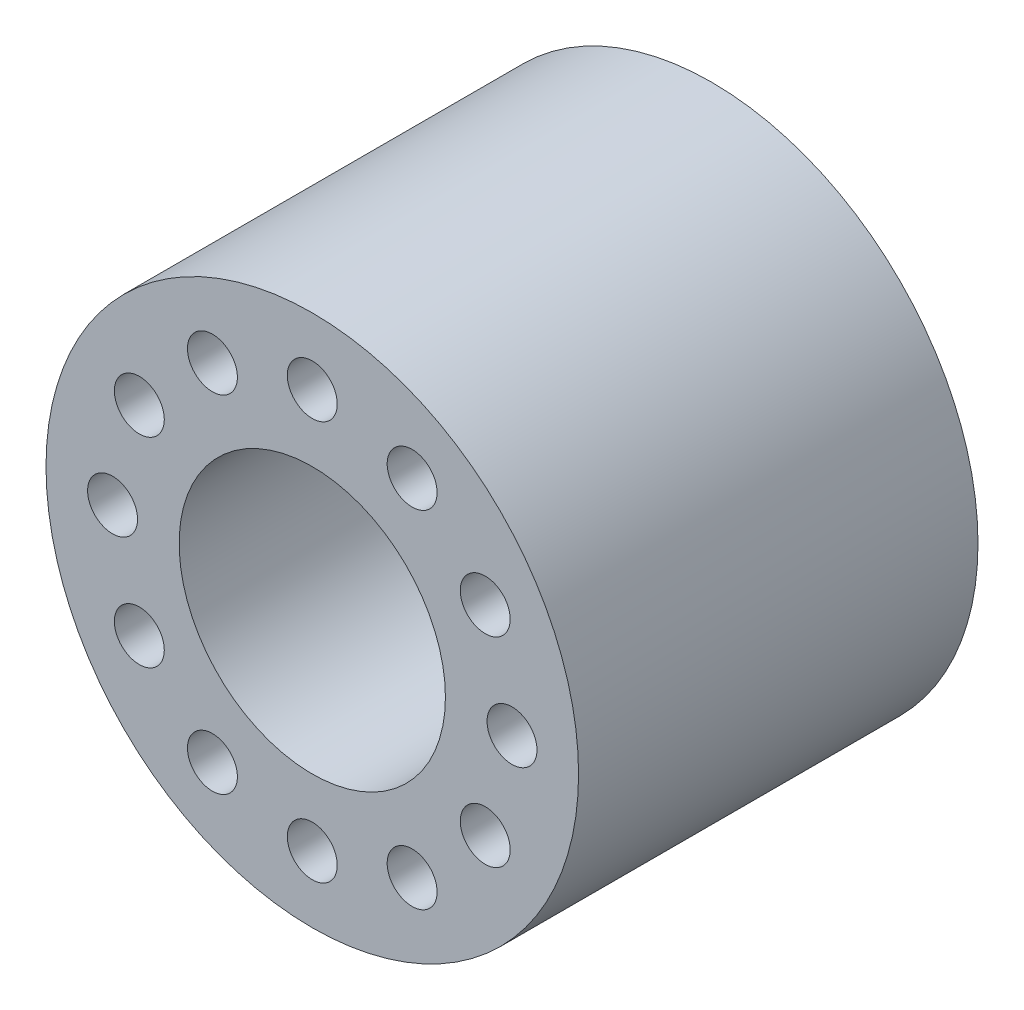
ISO-10303-21;
HEADER;
FILE_DESCRIPTION(('STEP AP214'),'2;1');
FILE_NAME('part.step','',(''),(''),'','','');
FILE_SCHEMA(('AUTOMOTIVE_DESIGN { 1 0 10303 214 1 1 1 1 }'));
ENDSEC;
DATA;
#1=APPLICATION_CONTEXT('core data for automotive mechanical design processes');
#2=APPLICATION_PROTOCOL_DEFINITION('international standard','automotive_design',2000,#1);
#3=PRODUCT_CONTEXT('',#1,'mechanical');
#4=PRODUCT('Part','Part','',(#3));
#5=PRODUCT_RELATED_PRODUCT_CATEGORY('part','',(#4));
#6=PRODUCT_DEFINITION_FORMATION('','',#4);
#7=PRODUCT_DEFINITION_CONTEXT('part definition',#1,'design');
#8=PRODUCT_DEFINITION('design','',#6,#7);
#9=PRODUCT_DEFINITION_SHAPE('','',#8);
#10=(LENGTH_UNIT() NAMED_UNIT(*) SI_UNIT(.MILLI.,.METRE.));
#11=(NAMED_UNIT(*) PLANE_ANGLE_UNIT() SI_UNIT($,.RADIAN.));
#12=(NAMED_UNIT(*) SI_UNIT($,.STERADIAN.) SOLID_ANGLE_UNIT());
#13=UNCERTAINTY_MEASURE_WITH_UNIT(LENGTH_MEASURE(1.E-05),#10,'distance_accuracy_value','');
#14=(GEOMETRIC_REPRESENTATION_CONTEXT(3) GLOBAL_UNCERTAINTY_ASSIGNED_CONTEXT((#13)) GLOBAL_UNIT_ASSIGNED_CONTEXT((#10,
#11,#12)) REPRESENTATION_CONTEXT('',''));
#15=CARTESIAN_POINT('',(0.,0.,0.));
#16=DIRECTION('',(0.,0.,1.));
#17=DIRECTION('',(1.,0.,0.));
#18=AXIS2_PLACEMENT_3D('',#15,#16,#17);
#19=CARTESIAN_POINT('',(0.,0.,12.));
#20=DIRECTION('',(0.,0.,1.));
#21=DIRECTION('',(1.,0.,0.));
#22=AXIS2_PLACEMENT_3D('',#19,#20,#21);
#23=PLANE('',#22);
#24=CARTESIAN_POINT('',(5.19615242270694,3.00000000000009,12.));
#25=DIRECTION('',(0.,0.,1.));
#26=DIRECTION('',(1.,0.,0.));
#27=AXIS2_PLACEMENT_3D('',#24,#25,#26);
#28=CIRCLE('',#27,0.749999999999707);
#29=CARTESIAN_POINT('',(5.94615242270664,3.00000000000009,12.));
#30=VERTEX_POINT('',#29);
#31=EDGE_CURVE('E108',#30,#30,#28,.T.);
#32=ORIENTED_EDGE('',*,*,#31,.F.);
#33=EDGE_LOOP('',(#32));
#34=FACE_BOUND('',#33,.T.);
#35=CARTESIAN_POINT('',(6.16519792277722E-13,6.00000000000062,12.));
#36=DIRECTION('',(0.,0.,1.));
#37=DIRECTION('',(1.,0.,0.));
#38=AXIS2_PLACEMENT_3D('',#35,#36,#37);
#39=CIRCLE('',#38,0.749999999999573);
#40=CARTESIAN_POINT('',(0.750000000000189,6.00000000000062,12.));
#41=VERTEX_POINT('',#40);
#42=EDGE_CURVE('E96',#41,#41,#39,.T.);
#43=ORIENTED_EDGE('',*,*,#42,.F.);
#44=EDGE_LOOP('',(#43));
#45=FACE_BOUND('',#44,.T.);
#46=CARTESIAN_POINT('',(-5.19615242270632,3.00000000000115,12.));
#47=DIRECTION('',(0.,0.,1.));
#48=DIRECTION('',(1.,0.,0.));
#49=AXIS2_PLACEMENT_3D('',#46,#47,#48);
#50=CIRCLE('',#49,0.75000000000003);
#51=CARTESIAN_POINT('',(-4.44615242270629,3.00000000000115,12.));
#52=VERTEX_POINT('',#51);
#53=EDGE_CURVE('E84',#52,#52,#50,.T.);
#54=ORIENTED_EDGE('',*,*,#53,.F.);
#55=EDGE_LOOP('',(#54));
#56=FACE_BOUND('',#55,.T.);
#57=CARTESIAN_POINT('',(-5.19615242270694,-2.99999999999885,12.));
#58=DIRECTION('',(0.,0.,1.));
#59=DIRECTION('',(1.,0.,0.));
#60=AXIS2_PLACEMENT_3D('',#57,#58,#59);
#61=CIRCLE('',#60,0.750000000000624);
#62=CARTESIAN_POINT('',(-4.44615242270632,-2.99999999999885,12.));
#63=VERTEX_POINT('',#62);
#64=EDGE_CURVE('E72',#63,#63,#61,.T.);
#65=ORIENTED_EDGE('',*,*,#64,.F.);
#66=EDGE_LOOP('',(#65));
#67=FACE_BOUND('',#66,.T.);
#68=CARTESIAN_POINT('',(-6.17254580357209E-13,-5.99999999999938,12.));
#69=DIRECTION('',(0.,0.,1.));
#70=DIRECTION('',(1.,0.,0.));
#71=AXIS2_PLACEMENT_3D('',#68,#69,#70);
#72=CIRCLE('',#71,0.750000000000767);
#73=CARTESIAN_POINT('',(0.75000000000015,-5.99999999999938,12.));
#74=VERTEX_POINT('',#73);
#75=EDGE_CURVE('E60',#74,#74,#72,.T.);
#76=ORIENTED_EDGE('',*,*,#75,.F.);
#77=EDGE_LOOP('',(#76));
#78=FACE_BOUND('',#77,.T.);
#79=CARTESIAN_POINT('',(5.19615242270632,-2.99999999999992,12.));
#80=DIRECTION('',(0.,0.,1.));
#81=DIRECTION('',(1.,0.,0.));
#82=AXIS2_PLACEMENT_3D('',#79,#80,#81);
#83=CIRCLE('',#82,0.750000000000318);
#84=CARTESIAN_POINT('',(5.94615242270664,-2.99999999999992,12.));
#85=VERTEX_POINT('',#84);
#86=EDGE_CURVE('E48',#85,#85,#83,.T.);
#87=ORIENTED_EDGE('',*,*,#86,.F.);
#88=EDGE_LOOP('',(#87));
#89=FACE_BOUND('',#88,.T.);
#90=CARTESIAN_POINT('',(0.,0.,12.));
#91=DIRECTION('',(0.,0.,1.));
#92=DIRECTION('',(1.,0.,0.));
#93=AXIS2_PLACEMENT_3D('',#90,#91,#92);
#94=CIRCLE('',#93,8.);
#95=CARTESIAN_POINT('',(8.,0.,12.));
#96=VERTEX_POINT('',#95);
#97=EDGE_CURVE('E10',#96,#96,#94,.T.);
#98=ORIENTED_EDGE('',*,*,#97,.T.);
#99=EDGE_LOOP('',(#98));
#100=FACE_BOUND('',#99,.T.);
#101=CARTESIAN_POINT('',(6.,0.,12.));
#102=DIRECTION('',(0.,0.,1.));
#103=DIRECTION('',(1.,0.,0.));
#104=AXIS2_PLACEMENT_3D('',#101,#102,#103);
#105=CIRCLE('',#104,0.750000000000002);
#106=CARTESIAN_POINT('',(6.75,0.,12.));
#107=VERTEX_POINT('',#106);
#108=EDGE_CURVE('E43',#107,#107,#105,.T.);
#109=ORIENTED_EDGE('',*,*,#108,.F.);
#110=EDGE_LOOP('',(#109));
#111=FACE_BOUND('',#110,.T.);
#112=CARTESIAN_POINT('',(2.99999999999947,-5.19615242270632,12.));
#113=DIRECTION('',(0.,0.,1.));
#114=DIRECTION('',(1.,0.,0.));
#115=AXIS2_PLACEMENT_3D('',#112,#113,#114);
#116=CIRCLE('',#115,0.750000000000599);
#117=CARTESIAN_POINT('',(3.75000000000006,-5.19615242270632,12.));
#118=VERTEX_POINT('',#117);
#119=EDGE_CURVE('E54',#118,#118,#116,.T.);
#120=ORIENTED_EDGE('',*,*,#119,.F.);
#121=EDGE_LOOP('',(#120));
#122=FACE_BOUND('',#121,.T.);
#123=CARTESIAN_POINT('',(-3.00000000000053,-5.19615242270571,12.));
#124=DIRECTION('',(0.,0.,1.));
#125=DIRECTION('',(1.,0.,0.));
#126=AXIS2_PLACEMENT_3D('',#123,#124,#125);
#127=CIRCLE('',#126,0.750000000000777);
#128=CARTESIAN_POINT('',(-2.24999999999976,-5.19615242270571,12.));
#129=VERTEX_POINT('',#128);
#130=EDGE_CURVE('E66',#129,#129,#127,.T.);
#131=ORIENTED_EDGE('',*,*,#130,.F.);
#132=EDGE_LOOP('',(#131));
#133=FACE_BOUND('',#132,.T.);
#134=CARTESIAN_POINT('',(-6.,1.23450916071442E-12,12.));
#135=DIRECTION('',(0.,0.,1.));
#136=DIRECTION('',(1.,0.,0.));
#137=AXIS2_PLACEMENT_3D('',#134,#135,#136);
#138=CIRCLE('',#137,0.750000000000351);
#139=CARTESIAN_POINT('',(-5.24999999999965,1.23450916071442E-12,12.));
#140=VERTEX_POINT('',#139);
#141=EDGE_CURVE('E78',#140,#140,#138,.T.);
#142=ORIENTED_EDGE('',*,*,#141,.F.);
#143=EDGE_LOOP('',(#142));
#144=FACE_BOUND('',#143,.T.);
#145=CARTESIAN_POINT('',(-2.99999999999947,5.19615242270756,12.));
#146=DIRECTION('',(0.,0.,1.));
#147=DIRECTION('',(1.,0.,0.));
#148=AXIS2_PLACEMENT_3D('',#145,#146,#147);
#149=CIRCLE('',#148,0.749999999999745);
#150=CARTESIAN_POINT('',(-2.24999999999972,5.19615242270756,12.));
#151=VERTEX_POINT('',#150);
#152=EDGE_CURVE('E90',#151,#151,#149,.T.);
#153=ORIENTED_EDGE('',*,*,#152,.F.);
#154=EDGE_LOOP('',(#153));
#155=FACE_BOUND('',#154,.T.);
#156=CARTESIAN_POINT('',(3.00000000000053,5.19615242270694,12.));
#157=DIRECTION('',(0.,0.,1.));
#158=DIRECTION('',(1.,0.,0.));
#159=AXIS2_PLACEMENT_3D('',#156,#157,#158);
#160=CIRCLE('',#159,0.749999999999559);
#161=CARTESIAN_POINT('',(3.75000000000009,5.19615242270694,12.));
#162=VERTEX_POINT('',#161);
#163=EDGE_CURVE('E102',#162,#162,#160,.T.);
#164=ORIENTED_EDGE('',*,*,#163,.F.);
#165=EDGE_LOOP('',(#164));
#166=FACE_BOUND('',#165,.T.);
#167=CARTESIAN_POINT('',(0.,0.,12.));
#168=DIRECTION('',(0.,0.,1.));
#169=DIRECTION('',(1.,0.,0.));
#170=AXIS2_PLACEMENT_3D('',#167,#168,#169);
#171=CIRCLE('',#170,4.);
#172=CARTESIAN_POINT('',(4.,0.,12.));
#173=VERTEX_POINT('',#172);
#174=EDGE_CURVE('E114',#173,#173,#171,.T.);
#175=ORIENTED_EDGE('',*,*,#174,.F.);
#176=EDGE_LOOP('',(#175));
#177=FACE_BOUND('',#176,.T.);
#178=ADVANCED_FACE('F32',(#34,#45,#56,#67,#78,#89,#100,#111,#122,#133,#144,#155,#166,#177),#23,.T.);
#179=CARTESIAN_POINT('',(0.,0.,0.));
#180=DIRECTION('',(0.,0.,1.));
#181=DIRECTION('',(1.,0.,0.));
#182=AXIS2_PLACEMENT_3D('',#179,#180,#181);
#183=PLANE('',#182);
#184=CARTESIAN_POINT('',(0.,0.,0.));
#185=DIRECTION('',(0.,0.,1.));
#186=DIRECTION('',(1.,0.,0.));
#187=AXIS2_PLACEMENT_3D('',#184,#185,#186);
#188=CIRCLE('',#187,8.);
#189=CARTESIAN_POINT('',(8.,0.,0.));
#190=VERTEX_POINT('',#189);
#191=EDGE_CURVE('E36',#190,#190,#188,.T.);
#192=ORIENTED_EDGE('',*,*,#191,.F.);
#193=EDGE_LOOP('',(#192));
#194=FACE_BOUND('',#193,.T.);
#195=CARTESIAN_POINT('',(6.,0.,0.));
#196=DIRECTION('',(0.,0.,1.));
#197=DIRECTION('',(1.,0.,0.));
#198=AXIS2_PLACEMENT_3D('',#195,#196,#197);
#199=CIRCLE('',#198,0.750000000000002);
#200=CARTESIAN_POINT('',(6.75,0.,0.));
#201=VERTEX_POINT('',#200);
#202=EDGE_CURVE('E45',#201,#201,#199,.T.);
#203=ORIENTED_EDGE('',*,*,#202,.T.);
#204=EDGE_LOOP('',(#203));
#205=FACE_BOUND('',#204,.T.);
#206=CARTESIAN_POINT('',(5.19615242270632,-2.99999999999992,0.));
#207=DIRECTION('',(0.,0.,1.));
#208=DIRECTION('',(1.,0.,0.));
#209=AXIS2_PLACEMENT_3D('',#206,#207,#208);
#210=CIRCLE('',#209,0.750000000000318);
#211=CARTESIAN_POINT('',(5.94615242270664,-2.99999999999992,0.));
#212=VERTEX_POINT('',#211);
#213=EDGE_CURVE('E51',#212,#212,#210,.T.);
#214=ORIENTED_EDGE('',*,*,#213,.T.);
#215=EDGE_LOOP('',(#214));
#216=FACE_BOUND('',#215,.T.);
#217=CARTESIAN_POINT('',(2.99999999999947,-5.19615242270632,0.));
#218=DIRECTION('',(0.,0.,1.));
#219=DIRECTION('',(1.,0.,0.));
#220=AXIS2_PLACEMENT_3D('',#217,#218,#219);
#221=CIRCLE('',#220,0.750000000000599);
#222=CARTESIAN_POINT('',(3.75000000000006,-5.19615242270632,0.));
#223=VERTEX_POINT('',#222);
#224=EDGE_CURVE('E57',#223,#223,#221,.T.);
#225=ORIENTED_EDGE('',*,*,#224,.T.);
#226=EDGE_LOOP('',(#225));
#227=FACE_BOUND('',#226,.T.);
#228=CARTESIAN_POINT('',(-6.17254580357209E-13,-5.99999999999938,0.));
#229=DIRECTION('',(0.,0.,1.));
#230=DIRECTION('',(1.,0.,0.));
#231=AXIS2_PLACEMENT_3D('',#228,#229,#230);
#232=CIRCLE('',#231,0.750000000000767);
#233=CARTESIAN_POINT('',(0.75000000000015,-5.99999999999938,0.));
#234=VERTEX_POINT('',#233);
#235=EDGE_CURVE('E63',#234,#234,#232,.T.);
#236=ORIENTED_EDGE('',*,*,#235,.T.);
#237=EDGE_LOOP('',(#236));
#238=FACE_BOUND('',#237,.T.);
#239=CARTESIAN_POINT('',(-3.00000000000053,-5.19615242270571,0.));
#240=DIRECTION('',(0.,0.,1.));
#241=DIRECTION('',(1.,0.,0.));
#242=AXIS2_PLACEMENT_3D('',#239,#240,#241);
#243=CIRCLE('',#242,0.750000000000777);
#244=CARTESIAN_POINT('',(-2.24999999999976,-5.19615242270571,0.));
#245=VERTEX_POINT('',#244);
#246=EDGE_CURVE('E69',#245,#245,#243,.T.);
#247=ORIENTED_EDGE('',*,*,#246,.T.);
#248=EDGE_LOOP('',(#247));
#249=FACE_BOUND('',#248,.T.);
#250=CARTESIAN_POINT('',(-5.19615242270694,-2.99999999999885,0.));
#251=DIRECTION('',(0.,0.,1.));
#252=DIRECTION('',(1.,0.,0.));
#253=AXIS2_PLACEMENT_3D('',#250,#251,#252);
#254=CIRCLE('',#253,0.750000000000624);
#255=CARTESIAN_POINT('',(-4.44615242270632,-2.99999999999885,0.));
#256=VERTEX_POINT('',#255);
#257=EDGE_CURVE('E75',#256,#256,#254,.T.);
#258=ORIENTED_EDGE('',*,*,#257,.T.);
#259=EDGE_LOOP('',(#258));
#260=FACE_BOUND('',#259,.T.);
#261=CARTESIAN_POINT('',(-6.,1.23450916071442E-12,0.));
#262=DIRECTION('',(0.,0.,1.));
#263=DIRECTION('',(1.,0.,0.));
#264=AXIS2_PLACEMENT_3D('',#261,#262,#263);
#265=CIRCLE('',#264,0.750000000000351);
#266=CARTESIAN_POINT('',(-5.24999999999965,1.23450916071442E-12,0.));
#267=VERTEX_POINT('',#266);
#268=EDGE_CURVE('E81',#267,#267,#265,.T.);
#269=ORIENTED_EDGE('',*,*,#268,.T.);
#270=EDGE_LOOP('',(#269));
#271=FACE_BOUND('',#270,.T.);
#272=CARTESIAN_POINT('',(-5.19615242270632,3.00000000000115,0.));
#273=DIRECTION('',(0.,0.,1.));
#274=DIRECTION('',(1.,0.,0.));
#275=AXIS2_PLACEMENT_3D('',#272,#273,#274);
#276=CIRCLE('',#275,0.75000000000003);
#277=CARTESIAN_POINT('',(-4.44615242270629,3.00000000000115,0.));
#278=VERTEX_POINT('',#277);
#279=EDGE_CURVE('E87',#278,#278,#276,.T.);
#280=ORIENTED_EDGE('',*,*,#279,.T.);
#281=EDGE_LOOP('',(#280));
#282=FACE_BOUND('',#281,.T.);
#283=CARTESIAN_POINT('',(-2.99999999999947,5.19615242270756,0.));
#284=DIRECTION('',(0.,0.,1.));
#285=DIRECTION('',(1.,0.,0.));
#286=AXIS2_PLACEMENT_3D('',#283,#284,#285);
#287=CIRCLE('',#286,0.749999999999745);
#288=CARTESIAN_POINT('',(-2.24999999999972,5.19615242270756,0.));
#289=VERTEX_POINT('',#288);
#290=EDGE_CURVE('E93',#289,#289,#287,.T.);
#291=ORIENTED_EDGE('',*,*,#290,.T.);
#292=EDGE_LOOP('',(#291));
#293=FACE_BOUND('',#292,.T.);
#294=CARTESIAN_POINT('',(6.16519792277722E-13,6.00000000000062,0.));
#295=DIRECTION('',(0.,0.,1.));
#296=DIRECTION('',(1.,0.,0.));
#297=AXIS2_PLACEMENT_3D('',#294,#295,#296);
#298=CIRCLE('',#297,0.749999999999573);
#299=CARTESIAN_POINT('',(0.750000000000189,6.00000000000062,0.));
#300=VERTEX_POINT('',#299);
#301=EDGE_CURVE('E99',#300,#300,#298,.T.);
#302=ORIENTED_EDGE('',*,*,#301,.T.);
#303=EDGE_LOOP('',(#302));
#304=FACE_BOUND('',#303,.T.);
#305=CARTESIAN_POINT('',(3.00000000000053,5.19615242270694,0.));
#306=DIRECTION('',(0.,0.,1.));
#307=DIRECTION('',(1.,0.,0.));
#308=AXIS2_PLACEMENT_3D('',#305,#306,#307);
#309=CIRCLE('',#308,0.749999999999559);
#310=CARTESIAN_POINT('',(3.75000000000009,5.19615242270694,0.));
#311=VERTEX_POINT('',#310);
#312=EDGE_CURVE('E105',#311,#311,#309,.T.);
#313=ORIENTED_EDGE('',*,*,#312,.T.);
#314=EDGE_LOOP('',(#313));
#315=FACE_BOUND('',#314,.T.);
#316=CARTESIAN_POINT('',(5.19615242270694,3.00000000000009,0.));
#317=DIRECTION('',(0.,0.,1.));
#318=DIRECTION('',(1.,0.,0.));
#319=AXIS2_PLACEMENT_3D('',#316,#317,#318);
#320=CIRCLE('',#319,0.749999999999707);
#321=CARTESIAN_POINT('',(5.94615242270664,3.00000000000009,0.));
#322=VERTEX_POINT('',#321);
#323=EDGE_CURVE('E111',#322,#322,#320,.T.);
#324=ORIENTED_EDGE('',*,*,#323,.T.);
#325=EDGE_LOOP('',(#324));
#326=FACE_BOUND('',#325,.T.);
#327=CARTESIAN_POINT('',(0.,0.,0.));
#328=DIRECTION('',(0.,0.,1.));
#329=DIRECTION('',(1.,0.,0.));
#330=AXIS2_PLACEMENT_3D('',#327,#328,#329);
#331=CIRCLE('',#330,4.);
#332=CARTESIAN_POINT('',(4.,0.,0.));
#333=VERTEX_POINT('',#332);
#334=EDGE_CURVE('E117',#333,#333,#331,.T.);
#335=ORIENTED_EDGE('',*,*,#334,.T.);
#336=EDGE_LOOP('',(#335));
#337=FACE_BOUND('',#336,.T.);
#338=ADVANCED_FACE('F127',(#194,#205,#216,#227,#238,#249,#260,#271,#282,#293,#304,#315,#326,
#337),#183,.F.);
#339=CARTESIAN_POINT('',(0.,0.,12.));
#340=DIRECTION('',(0.,0.,-1.));
#341=DIRECTION('',(-1.,0.,0.));
#342=AXIS2_PLACEMENT_3D('',#339,#340,#341);
#343=CYLINDRICAL_SURFACE('',#342,8.);
#344=ORIENTED_EDGE('',*,*,#97,.F.);
#345=EDGE_LOOP('',(#344));
#346=FACE_BOUND('',#345,.T.);
#347=ORIENTED_EDGE('',*,*,#191,.T.);
#348=EDGE_LOOP('',(#347));
#349=FACE_BOUND('',#348,.T.);
#350=ADVANCED_FACE('F34',(#346,#349),#343,.T.);
#351=CARTESIAN_POINT('',(6.,0.,12.));
#352=DIRECTION('',(0.,0.,-1.));
#353=DIRECTION('',(-1.,0.,0.));
#354=AXIS2_PLACEMENT_3D('',#351,#352,#353);
#355=CYLINDRICAL_SURFACE('',#354,0.750000000000002);
#356=ORIENTED_EDGE('',*,*,#108,.T.);
#357=EDGE_LOOP('',(#356));
#358=FACE_BOUND('',#357,.T.);
#359=ORIENTED_EDGE('',*,*,#202,.F.);
#360=EDGE_LOOP('',(#359));
#361=FACE_BOUND('',#360,.T.);
#362=ADVANCED_FACE('F137',(#358,#361),#355,.F.);
#363=CARTESIAN_POINT('',(5.19615242270632,-2.99999999999992,12.));
#364=DIRECTION('',(0.,0.,-1.));
#365=DIRECTION('',(-1.,0.,0.));
#366=AXIS2_PLACEMENT_3D('',#363,#364,#365);
#367=CYLINDRICAL_SURFACE('',#366,0.750000000000318);
#368=ORIENTED_EDGE('',*,*,#86,.T.);
#369=EDGE_LOOP('',(#368));
#370=FACE_BOUND('',#369,.T.);
#371=ORIENTED_EDGE('',*,*,#213,.F.);
#372=EDGE_LOOP('',(#371));
#373=FACE_BOUND('',#372,.T.);
#374=ADVANCED_FACE('F140',(#370,#373),#367,.F.);
#375=CARTESIAN_POINT('',(2.99999999999947,-5.19615242270632,12.));
#376=DIRECTION('',(0.,0.,-1.));
#377=DIRECTION('',(-1.,0.,0.));
#378=AXIS2_PLACEMENT_3D('',#375,#376,#377);
#379=CYLINDRICAL_SURFACE('',#378,0.750000000000599);
#380=ORIENTED_EDGE('',*,*,#119,.T.);
#381=EDGE_LOOP('',(#380));
#382=FACE_BOUND('',#381,.T.);
#383=ORIENTED_EDGE('',*,*,#224,.F.);
#384=EDGE_LOOP('',(#383));
#385=FACE_BOUND('',#384,.T.);
#386=ADVANCED_FACE('F144',(#382,#385),#379,.F.);
#387=CARTESIAN_POINT('',(-6.17254580357209E-13,-5.99999999999938,12.));
#388=DIRECTION('',(0.,0.,-1.));
#389=DIRECTION('',(-1.,0.,0.));
#390=AXIS2_PLACEMENT_3D('',#387,#388,#389);
#391=CYLINDRICAL_SURFACE('',#390,0.750000000000767);
#392=ORIENTED_EDGE('',*,*,#75,.T.);
#393=EDGE_LOOP('',(#392));
#394=FACE_BOUND('',#393,.T.);
#395=ORIENTED_EDGE('',*,*,#235,.F.);
#396=EDGE_LOOP('',(#395));
#397=FACE_BOUND('',#396,.T.);
#398=ADVANCED_FACE('F148',(#394,#397),#391,.F.);
#399=CARTESIAN_POINT('',(-3.00000000000053,-5.19615242270571,12.));
#400=DIRECTION('',(0.,0.,-1.));
#401=DIRECTION('',(-1.,0.,0.));
#402=AXIS2_PLACEMENT_3D('',#399,#400,#401);
#403=CYLINDRICAL_SURFACE('',#402,0.750000000000777);
#404=ORIENTED_EDGE('',*,*,#130,.T.);
#405=EDGE_LOOP('',(#404));
#406=FACE_BOUND('',#405,.T.);
#407=ORIENTED_EDGE('',*,*,#246,.F.);
#408=EDGE_LOOP('',(#407));
#409=FACE_BOUND('',#408,.T.);
#410=ADVANCED_FACE('F152',(#406,#409),#403,.F.);
#411=CARTESIAN_POINT('',(-5.19615242270694,-2.99999999999885,12.));
#412=DIRECTION('',(0.,0.,-1.));
#413=DIRECTION('',(-1.,0.,0.));
#414=AXIS2_PLACEMENT_3D('',#411,#412,#413);
#415=CYLINDRICAL_SURFACE('',#414,0.750000000000624);
#416=ORIENTED_EDGE('',*,*,#64,.T.);
#417=EDGE_LOOP('',(#416));
#418=FACE_BOUND('',#417,.T.);
#419=ORIENTED_EDGE('',*,*,#257,.F.);
#420=EDGE_LOOP('',(#419));
#421=FACE_BOUND('',#420,.T.);
#422=ADVANCED_FACE('F156',(#418,#421),#415,.F.);
#423=CARTESIAN_POINT('',(-6.,1.23450916071442E-12,12.));
#424=DIRECTION('',(0.,0.,-1.));
#425=DIRECTION('',(-1.,0.,0.));
#426=AXIS2_PLACEMENT_3D('',#423,#424,#425);
#427=CYLINDRICAL_SURFACE('',#426,0.750000000000351);
#428=ORIENTED_EDGE('',*,*,#141,.T.);
#429=EDGE_LOOP('',(#428));
#430=FACE_BOUND('',#429,.T.);
#431=ORIENTED_EDGE('',*,*,#268,.F.);
#432=EDGE_LOOP('',(#431));
#433=FACE_BOUND('',#432,.T.);
#434=ADVANCED_FACE('F160',(#430,#433),#427,.F.);
#435=CARTESIAN_POINT('',(-5.19615242270632,3.00000000000115,12.));
#436=DIRECTION('',(0.,0.,-1.));
#437=DIRECTION('',(-1.,0.,0.));
#438=AXIS2_PLACEMENT_3D('',#435,#436,#437);
#439=CYLINDRICAL_SURFACE('',#438,0.75000000000003);
#440=ORIENTED_EDGE('',*,*,#53,.T.);
#441=EDGE_LOOP('',(#440));
#442=FACE_BOUND('',#441,.T.);
#443=ORIENTED_EDGE('',*,*,#279,.F.);
#444=EDGE_LOOP('',(#443));
#445=FACE_BOUND('',#444,.T.);
#446=ADVANCED_FACE('F164',(#442,#445),#439,.F.);
#447=CARTESIAN_POINT('',(-2.99999999999947,5.19615242270756,12.));
#448=DIRECTION('',(0.,0.,-1.));
#449=DIRECTION('',(-1.,0.,0.));
#450=AXIS2_PLACEMENT_3D('',#447,#448,#449);
#451=CYLINDRICAL_SURFACE('',#450,0.749999999999745);
#452=ORIENTED_EDGE('',*,*,#152,.T.);
#453=EDGE_LOOP('',(#452));
#454=FACE_BOUND('',#453,.T.);
#455=ORIENTED_EDGE('',*,*,#290,.F.);
#456=EDGE_LOOP('',(#455));
#457=FACE_BOUND('',#456,.T.);
#458=ADVANCED_FACE('F168',(#454,#457),#451,.F.);
#459=CARTESIAN_POINT('',(6.16519792277722E-13,6.00000000000062,12.));
#460=DIRECTION('',(0.,0.,-1.));
#461=DIRECTION('',(-1.,0.,0.));
#462=AXIS2_PLACEMENT_3D('',#459,#460,#461);
#463=CYLINDRICAL_SURFACE('',#462,0.749999999999573);
#464=ORIENTED_EDGE('',*,*,#42,.T.);
#465=EDGE_LOOP('',(#464));
#466=FACE_BOUND('',#465,.T.);
#467=ORIENTED_EDGE('',*,*,#301,.F.);
#468=EDGE_LOOP('',(#467));
#469=FACE_BOUND('',#468,.T.);
#470=ADVANCED_FACE('F172',(#466,#469),#463,.F.);
#471=CARTESIAN_POINT('',(3.00000000000053,5.19615242270694,12.));
#472=DIRECTION('',(0.,0.,-1.));
#473=DIRECTION('',(-1.,0.,0.));
#474=AXIS2_PLACEMENT_3D('',#471,#472,#473);
#475=CYLINDRICAL_SURFACE('',#474,0.749999999999559);
#476=ORIENTED_EDGE('',*,*,#163,.T.);
#477=EDGE_LOOP('',(#476));
#478=FACE_BOUND('',#477,.T.);
#479=ORIENTED_EDGE('',*,*,#312,.F.);
#480=EDGE_LOOP('',(#479));
#481=FACE_BOUND('',#480,.T.);
#482=ADVANCED_FACE('F176',(#478,#481),#475,.F.);
#483=CARTESIAN_POINT('',(5.19615242270694,3.00000000000009,12.));
#484=DIRECTION('',(0.,0.,-1.));
#485=DIRECTION('',(-1.,0.,0.));
#486=AXIS2_PLACEMENT_3D('',#483,#484,#485);
#487=CYLINDRICAL_SURFACE('',#486,0.749999999999707);
#488=ORIENTED_EDGE('',*,*,#31,.T.);
#489=EDGE_LOOP('',(#488));
#490=FACE_BOUND('',#489,.T.);
#491=ORIENTED_EDGE('',*,*,#323,.F.);
#492=EDGE_LOOP('',(#491));
#493=FACE_BOUND('',#492,.T.);
#494=ADVANCED_FACE('F180',(#490,#493),#487,.F.);
#495=CARTESIAN_POINT('',(0.,0.,12.));
#496=DIRECTION('',(0.,0.,-1.));
#497=DIRECTION('',(-1.,0.,0.));
#498=AXIS2_PLACEMENT_3D('',#495,#496,#497);
#499=CYLINDRICAL_SURFACE('',#498,4.);
#500=ORIENTED_EDGE('',*,*,#174,.T.);
#501=EDGE_LOOP('',(#500));
#502=FACE_BOUND('',#501,.T.);
#503=ORIENTED_EDGE('',*,*,#334,.F.);
#504=EDGE_LOOP('',(#503));
#505=FACE_BOUND('',#504,.T.);
#506=ADVANCED_FACE('F123',(#502,#505),#499,.F.);
#507=CLOSED_SHELL('',(#178,#338,#350,#362,#374,#386,#398,#410,#422,#434,#446,#458,#470,#482,
#494,#506));
#508=MANIFOLD_SOLID_BREP('B2',#507);
#509=ADVANCED_BREP_SHAPE_REPRESENTATION('',(#18,#508),#14);
#510=SHAPE_DEFINITION_REPRESENTATION(#9,#509);
ENDSEC;
END-ISO-10303-21;
